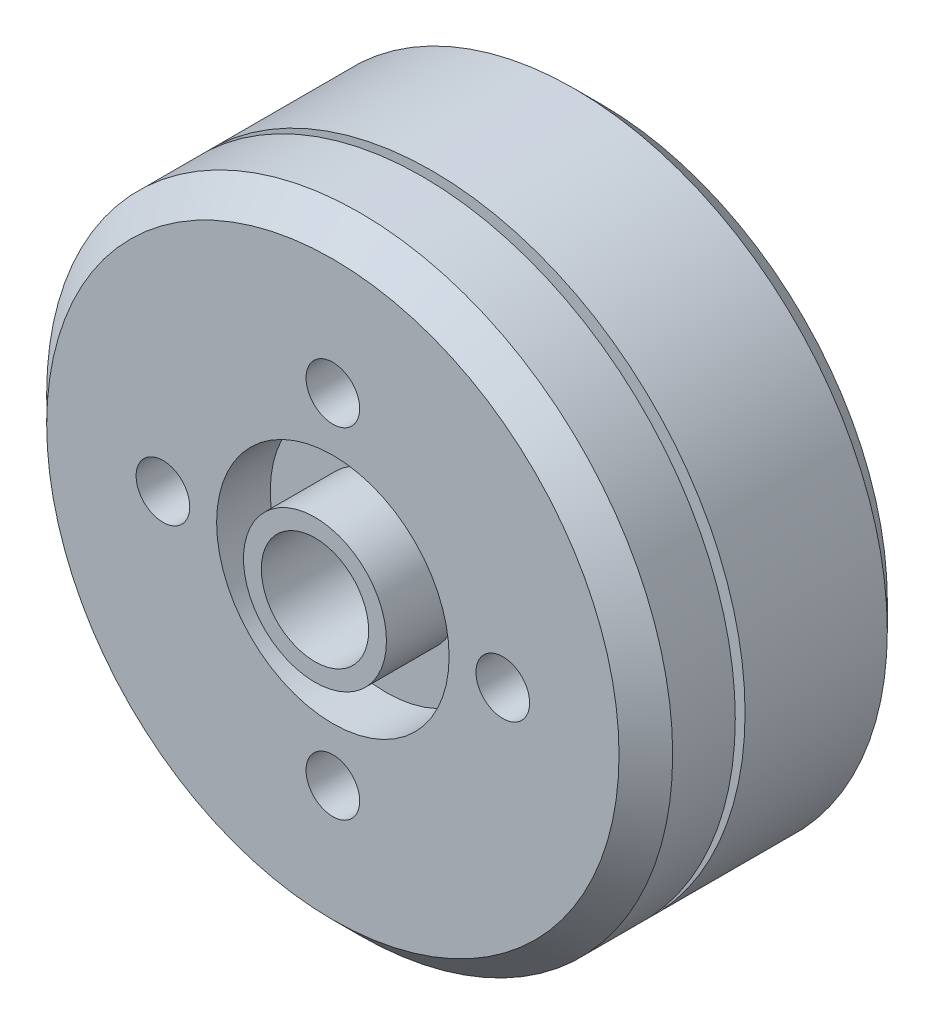
ISO-10303-21;
HEADER;
FILE_DESCRIPTION(('STEP AP214'),'2;1');
FILE_NAME('part.step','',(''),(''),'','','');
FILE_SCHEMA(('AUTOMOTIVE_DESIGN { 1 0 10303 214 1 1 1 1 }'));
ENDSEC;
DATA;
#1=APPLICATION_CONTEXT('core data for automotive mechanical design processes');
#2=APPLICATION_PROTOCOL_DEFINITION('international standard','automotive_design',2000,#1);
#3=PRODUCT_CONTEXT('',#1,'mechanical');
#4=PRODUCT('Part','Part','',(#3));
#5=PRODUCT_RELATED_PRODUCT_CATEGORY('part','',(#4));
#6=PRODUCT_DEFINITION_FORMATION('','',#4);
#7=PRODUCT_DEFINITION_CONTEXT('part definition',#1,'design');
#8=PRODUCT_DEFINITION('design','',#6,#7);
#9=PRODUCT_DEFINITION_SHAPE('','',#8);
#10=(LENGTH_UNIT() NAMED_UNIT(*) SI_UNIT(.MILLI.,.METRE.));
#11=(NAMED_UNIT(*) PLANE_ANGLE_UNIT() SI_UNIT($,.RADIAN.));
#12=(NAMED_UNIT(*) SI_UNIT($,.STERADIAN.) SOLID_ANGLE_UNIT());
#13=UNCERTAINTY_MEASURE_WITH_UNIT(LENGTH_MEASURE(1.E-05),#10,'distance_accuracy_value','');
#14=(GEOMETRIC_REPRESENTATION_CONTEXT(3) GLOBAL_UNCERTAINTY_ASSIGNED_CONTEXT((#13)) GLOBAL_UNIT_ASSIGNED_CONTEXT((#10,
#11,#12)) REPRESENTATION_CONTEXT('',''));
#15=CARTESIAN_POINT('',(0.,0.,0.));
#16=DIRECTION('',(0.,0.,1.));
#17=DIRECTION('',(1.,0.,0.));
#18=AXIS2_PLACEMENT_3D('',#15,#16,#17);
#19=CARTESIAN_POINT('',(0.,0.,15.));
#20=DIRECTION('',(0.,0.,-1.));
#21=DIRECTION('',(-1.,0.,0.));
#22=AXIS2_PLACEMENT_3D('',#19,#20,#21);
#23=CYLINDRICAL_SURFACE('',#22,17.5);
#24=CARTESIAN_POINT('',(0.,0.,1.5));
#25=DIRECTION('',(0.,0.,1.));
#26=DIRECTION('',(1.,0.,0.));
#27=AXIS2_PLACEMENT_3D('',#24,#25,#26);
#28=CIRCLE('',#27,17.5);
#29=CARTESIAN_POINT('',(17.5,0.,1.5));
#30=VERTEX_POINT('',#29);
#31=EDGE_CURVE('E45',#30,#30,#28,.T.);
#32=ORIENTED_EDGE('',*,*,#31,.T.);
#33=EDGE_LOOP('',(#32));
#34=FACE_BOUND('',#33,.T.);
#35=CARTESIAN_POINT('',(0.,0.,9.45314457112844));
#36=DIRECTION('',(0.,0.,-1.));
#37=DIRECTION('',(-1.,0.,0.));
#38=AXIS2_PLACEMENT_3D('',#35,#36,#37);
#39=CIRCLE('',#38,17.5);
#40=CARTESIAN_POINT('',(-17.5,0.,9.45314457112844));
#41=VERTEX_POINT('',#40);
#42=EDGE_CURVE('E67',#41,#41,#39,.T.);
#43=ORIENTED_EDGE('',*,*,#42,.T.);
#44=EDGE_LOOP('',(#43));
#45=FACE_BOUND('',#44,.T.);
#46=ADVANCED_FACE('F37',(#34,#45),#23,.T.);
#47=CARTESIAN_POINT('',(0.,0.,0.));
#48=DIRECTION('',(0.,0.,1.));
#49=DIRECTION('',(1.,0.,0.));
#50=AXIS2_PLACEMENT_3D('',#47,#48,#49);
#51=PLANE('',#50);
#52=CARTESIAN_POINT('',(0.,0.,0.));
#53=DIRECTION('',(0.,0.,1.));
#54=DIRECTION('',(1.,0.,0.));
#55=AXIS2_PLACEMENT_3D('',#52,#53,#54);
#56=CIRCLE('',#55,16.);
#57=CARTESIAN_POINT('',(16.,0.,0.));
#58=VERTEX_POINT('',#57);
#59=EDGE_CURVE('E10',#58,#58,#56,.F.);
#60=ORIENTED_EDGE('',*,*,#59,.T.);
#61=EDGE_LOOP('',(#60));
#62=FACE_BOUND('',#61,.T.);
#63=CARTESIAN_POINT('',(0.,0.,0.));
#64=DIRECTION('',(0.,0.,-1.));
#65=DIRECTION('',(-1.,0.,0.));
#66=AXIS2_PLACEMENT_3D('',#63,#64,#65);
#67=CIRCLE('',#66,3.);
#68=CARTESIAN_POINT('',(-3.,0.,0.));
#69=VERTEX_POINT('',#68);
#70=EDGE_CURVE('E109',#69,#69,#67,.T.);
#71=ORIENTED_EDGE('',*,*,#70,.F.);
#72=EDGE_LOOP('',(#71));
#73=FACE_BOUND('',#72,.T.);
#74=CARTESIAN_POINT('',(0.,-8.,0.));
#75=DIRECTION('',(0.,0.,-1.));
#76=DIRECTION('',(-1.,0.,0.));
#77=AXIS2_PLACEMENT_3D('',#74,#75,#76);
#78=CIRCLE('',#77,1.5);
#79=CARTESIAN_POINT('',(-1.5,-8.,0.));
#80=VERTEX_POINT('',#79);
#81=EDGE_CURVE('E95',#80,#80,#78,.T.);
#82=ORIENTED_EDGE('',*,*,#81,.F.);
#83=EDGE_LOOP('',(#82));
#84=FACE_BOUND('',#83,.T.);
#85=CARTESIAN_POINT('',(8.,0.,0.));
#86=DIRECTION('',(0.,0.,-1.));
#87=DIRECTION('',(-1.,0.,0.));
#88=AXIS2_PLACEMENT_3D('',#85,#86,#87);
#89=CIRCLE('',#88,1.5);
#90=CARTESIAN_POINT('',(6.5,0.,0.));
#91=VERTEX_POINT('',#90);
#92=EDGE_CURVE('E87',#91,#91,#89,.T.);
#93=ORIENTED_EDGE('',*,*,#92,.F.);
#94=EDGE_LOOP('',(#93));
#95=FACE_BOUND('',#94,.T.);
#96=CARTESIAN_POINT('',(0.,8.,0.));
#97=DIRECTION('',(0.,0.,-1.));
#98=DIRECTION('',(-1.,0.,0.));
#99=AXIS2_PLACEMENT_3D('',#96,#97,#98);
#100=CIRCLE('',#99,1.5);
#101=CARTESIAN_POINT('',(-1.50000000000005,8.,0.));
#102=VERTEX_POINT('',#101);
#103=EDGE_CURVE('E79',#102,#102,#100,.T.);
#104=ORIENTED_EDGE('',*,*,#103,.F.);
#105=EDGE_LOOP('',(#104));
#106=FACE_BOUND('',#105,.T.);
#107=CARTESIAN_POINT('',(-8.,0.,0.));
#108=DIRECTION('',(0.,0.,-1.));
#109=DIRECTION('',(-1.,0.,0.));
#110=AXIS2_PLACEMENT_3D('',#107,#108,#109);
#111=CIRCLE('',#110,1.5);
#112=CARTESIAN_POINT('',(-9.5,0.,0.));
#113=VERTEX_POINT('',#112);
#114=EDGE_CURVE('E66',#113,#113,#111,.T.);
#115=ORIENTED_EDGE('',*,*,#114,.F.);
#116=EDGE_LOOP('',(#115));
#117=FACE_BOUND('',#116,.T.);
#118=ADVANCED_FACE('F180',(#62,#73,#84,#95,#106,#117),#51,.F.);
#119=CARTESIAN_POINT('',(-8.,0.,4.99999999999999));
#120=DIRECTION('',(0.,0.,-1.));
#121=DIRECTION('',(-1.,0.,0.));
#122=AXIS2_PLACEMENT_3D('',#119,#120,#121);
#123=CYLINDRICAL_SURFACE('',#122,1.5);
#124=CARTESIAN_POINT('',(-8.,0.,4.99999999999999));
#125=DIRECTION('',(0.,0.,-1.));
#126=DIRECTION('',(-1.,0.,0.));
#127=AXIS2_PLACEMENT_3D('',#124,#125,#126);
#128=CIRCLE('',#127,1.5);
#129=CARTESIAN_POINT('',(-9.5,0.,4.99999999999999));
#130=VERTEX_POINT('',#129);
#131=EDGE_CURVE('E75',#130,#130,#128,.T.);
#132=ORIENTED_EDGE('',*,*,#131,.F.);
#133=EDGE_LOOP('',(#132));
#134=FACE_BOUND('',#133,.T.);
#135=ORIENTED_EDGE('',*,*,#114,.T.);
#136=EDGE_LOOP('',(#135));
#137=FACE_BOUND('',#136,.T.);
#138=ADVANCED_FACE('F186',(#134,#137),#123,.F.);
#139=CARTESIAN_POINT('',(-8.,0.,4.99999999999999));
#140=DIRECTION('',(0.,0.,-1.));
#141=DIRECTION('',(-1.,0.,0.));
#142=AXIS2_PLACEMENT_3D('',#139,#140,#141);
#143=PLANE('',#142);
#144=ORIENTED_EDGE('',*,*,#131,.T.);
#145=EDGE_LOOP('',(#144));
#146=FACE_BOUND('',#145,.T.);
#147=ADVANCED_FACE('F242',(#146),#143,.T.);
#148=CARTESIAN_POINT('',(0.,8.,4.99999999999999));
#149=DIRECTION('',(0.,0.,-1.));
#150=DIRECTION('',(-1.,0.,0.));
#151=AXIS2_PLACEMENT_3D('',#148,#149,#150);
#152=CYLINDRICAL_SURFACE('',#151,1.5);
#153=CARTESIAN_POINT('',(0.,8.,4.99999999999999));
#154=DIRECTION('',(0.,0.,-1.));
#155=DIRECTION('',(-1.,0.,0.));
#156=AXIS2_PLACEMENT_3D('',#153,#154,#155);
#157=CIRCLE('',#156,1.5);
#158=CARTESIAN_POINT('',(-1.50000000000005,8.,4.99999999999999));
#159=VERTEX_POINT('',#158);
#160=EDGE_CURVE('E83',#159,#159,#157,.T.);
#161=ORIENTED_EDGE('',*,*,#160,.F.);
#162=EDGE_LOOP('',(#161));
#163=FACE_BOUND('',#162,.T.);
#164=ORIENTED_EDGE('',*,*,#103,.T.);
#165=EDGE_LOOP('',(#164));
#166=FACE_BOUND('',#165,.T.);
#167=ADVANCED_FACE('F238',(#163,#166),#152,.F.);
#168=CARTESIAN_POINT('',(0.,8.,4.99999999999999));
#169=DIRECTION('',(0.,0.,-1.));
#170=DIRECTION('',(-1.,0.,0.));
#171=AXIS2_PLACEMENT_3D('',#168,#169,#170);
#172=PLANE('',#171);
#173=ORIENTED_EDGE('',*,*,#160,.T.);
#174=EDGE_LOOP('',(#173));
#175=FACE_BOUND('',#174,.T.);
#176=ADVANCED_FACE('F234',(#175),#172,.T.);
#177=CARTESIAN_POINT('',(8.,0.,4.99999999999999));
#178=DIRECTION('',(0.,0.,-1.));
#179=DIRECTION('',(-1.,0.,0.));
#180=AXIS2_PLACEMENT_3D('',#177,#178,#179);
#181=CYLINDRICAL_SURFACE('',#180,1.5);
#182=CARTESIAN_POINT('',(8.,0.,4.99999999999999));
#183=DIRECTION('',(0.,0.,-1.));
#184=DIRECTION('',(-1.,0.,0.));
#185=AXIS2_PLACEMENT_3D('',#182,#183,#184);
#186=CIRCLE('',#185,1.5);
#187=CARTESIAN_POINT('',(6.5,0.,4.99999999999999));
#188=VERTEX_POINT('',#187);
#189=EDGE_CURVE('E91',#188,#188,#186,.T.);
#190=ORIENTED_EDGE('',*,*,#189,.F.);
#191=EDGE_LOOP('',(#190));
#192=FACE_BOUND('',#191,.T.);
#193=ORIENTED_EDGE('',*,*,#92,.T.);
#194=EDGE_LOOP('',(#193));
#195=FACE_BOUND('',#194,.T.);
#196=ADVANCED_FACE('F230',(#192,#195),#181,.F.);
#197=CARTESIAN_POINT('',(8.,0.,4.99999999999999));
#198=DIRECTION('',(0.,0.,-1.));
#199=DIRECTION('',(-1.,0.,0.));
#200=AXIS2_PLACEMENT_3D('',#197,#198,#199);
#201=PLANE('',#200);
#202=ORIENTED_EDGE('',*,*,#189,.T.);
#203=EDGE_LOOP('',(#202));
#204=FACE_BOUND('',#203,.T.);
#205=ADVANCED_FACE('F226',(#204),#201,.T.);
#206=CARTESIAN_POINT('',(0.,-8.,4.99999999999999));
#207=DIRECTION('',(0.,0.,-1.));
#208=DIRECTION('',(-1.,0.,0.));
#209=AXIS2_PLACEMENT_3D('',#206,#207,#208);
#210=CYLINDRICAL_SURFACE('',#209,1.5);
#211=CARTESIAN_POINT('',(0.,-8.,4.99999999999999));
#212=DIRECTION('',(0.,0.,-1.));
#213=DIRECTION('',(-1.,0.,0.));
#214=AXIS2_PLACEMENT_3D('',#211,#212,#213);
#215=CIRCLE('',#214,1.5);
#216=CARTESIAN_POINT('',(-1.5,-8.,4.99999999999999));
#217=VERTEX_POINT('',#216);
#218=EDGE_CURVE('E61',#217,#217,#215,.T.);
#219=ORIENTED_EDGE('',*,*,#218,.F.);
#220=EDGE_LOOP('',(#219));
#221=FACE_BOUND('',#220,.T.);
#222=ORIENTED_EDGE('',*,*,#81,.T.);
#223=EDGE_LOOP('',(#222));
#224=FACE_BOUND('',#223,.T.);
#225=ADVANCED_FACE('F218',(#221,#224),#210,.F.);
#226=CARTESIAN_POINT('',(0.,-8.,4.99999999999999));
#227=DIRECTION('',(0.,0.,-1.));
#228=DIRECTION('',(-1.,0.,0.));
#229=AXIS2_PLACEMENT_3D('',#226,#227,#228);
#230=PLANE('',#229);
#231=ORIENTED_EDGE('',*,*,#218,.T.);
#232=EDGE_LOOP('',(#231));
#233=FACE_BOUND('',#232,.T.);
#234=ADVANCED_FACE('F209',(#233),#230,.T.);
#235=CARTESIAN_POINT('',(17.969347124329,0.,10.));
#236=DIRECTION('',(0.,0.,1.));
#237=DIRECTION('',(1.,0.,0.));
#238=AXIS2_PLACEMENT_3D('',#235,#236,#237);
#239=PLANE('',#238);
#240=CARTESIAN_POINT('',(0.,0.,10.));
#241=DIRECTION('',(0.,0.,-1.));
#242=DIRECTION('',(-1.,0.,0.));
#243=AXIS2_PLACEMENT_3D('',#240,#241,#242);
#244=CIRCLE('',#243,13.2844337972272);
#245=CARTESIAN_POINT('',(-13.2844337972272,0.,10.));
#246=VERTEX_POINT('',#245);
#247=EDGE_CURVE('E105',#246,#246,#244,.T.);
#248=ORIENTED_EDGE('',*,*,#247,.F.);
#249=EDGE_LOOP('',(#248));
#250=FACE_BOUND('',#249,.T.);
#251=CARTESIAN_POINT('',(0.,0.,10.));
#252=DIRECTION('',(0.,0.,1.));
#253=DIRECTION('',(1.,0.,0.));
#254=AXIS2_PLACEMENT_3D('',#251,#252,#253);
#255=CIRCLE('',#254,17.5);
#256=CARTESIAN_POINT('',(17.5,0.,10.));
#257=VERTEX_POINT('',#256);
#258=EDGE_CURVE('E62',#257,#257,#255,.T.);
#259=ORIENTED_EDGE('',*,*,#258,.F.);
#260=EDGE_LOOP('',(#259));
#261=FACE_BOUND('',#260,.T.);
#262=ADVANCED_FACE('F206',(#250,#261),#239,.F.);
#263=CARTESIAN_POINT('',(13.2844337972272,0.,9.45314457112844));
#264=DIRECTION('',(0.,0.,-1.));
#265=DIRECTION('',(-1.,0.,0.));
#266=AXIS2_PLACEMENT_3D('',#263,#264,#265);
#267=PLANE('',#266);
#268=CARTESIAN_POINT('',(0.,0.,9.45314457112844));
#269=DIRECTION('',(0.,0.,-1.));
#270=DIRECTION('',(-1.,0.,0.));
#271=AXIS2_PLACEMENT_3D('',#268,#269,#270);
#272=CIRCLE('',#271,13.2844337972272);
#273=CARTESIAN_POINT('',(-13.2844337972272,0.,9.45314457112844));
#274=VERTEX_POINT('',#273);
#275=EDGE_CURVE('E71',#274,#274,#272,.T.);
#276=ORIENTED_EDGE('',*,*,#275,.T.);
#277=EDGE_LOOP('',(#276));
#278=FACE_BOUND('',#277,.T.);
#279=ORIENTED_EDGE('',*,*,#42,.F.);
#280=EDGE_LOOP('',(#279));
#281=FACE_BOUND('',#280,.T.);
#282=ADVANCED_FACE('F208',(#278,#281),#267,.F.);
#283=CARTESIAN_POINT('',(0.,0.,0.));
#284=DIRECTION('',(0.,0.,-1.));
#285=DIRECTION('',(-1.,0.,0.));
#286=AXIS2_PLACEMENT_3D('',#283,#284,#285);
#287=CYLINDRICAL_SURFACE('',#286,13.2844337972272);
#288=ORIENTED_EDGE('',*,*,#247,.T.);
#289=EDGE_LOOP('',(#288));
#290=FACE_BOUND('',#289,.T.);
#291=ORIENTED_EDGE('',*,*,#275,.F.);
#292=EDGE_LOOP('',(#291));
#293=FACE_BOUND('',#292,.T.);
#294=ADVANCED_FACE('F199',(#290,#293),#287,.T.);
#295=CARTESIAN_POINT('',(0.,0.,15.));
#296=DIRECTION('',(0.,0.,1.));
#297=DIRECTION('',(1.,0.,0.));
#298=AXIS2_PLACEMENT_3D('',#295,#296,#297);
#299=PLANE('',#298);
#300=CARTESIAN_POINT('',(0.,0.,15.));
#301=DIRECTION('',(0.,0.,1.));
#302=DIRECTION('',(1.,0.,0.));
#303=AXIS2_PLACEMENT_3D('',#300,#301,#302);
#304=CIRCLE('',#303,6.5);
#305=CARTESIAN_POINT('',(6.5,0.,15.));
#306=VERTEX_POINT('',#305);
#307=EDGE_CURVE('E146',#306,#306,#304,.T.);
#308=ORIENTED_EDGE('',*,*,#307,.F.);
#309=EDGE_LOOP('',(#308));
#310=FACE_BOUND('',#309,.T.);
#311=CARTESIAN_POINT('',(0.,0.,15.));
#312=DIRECTION('',(0.,0.,1.));
#313=DIRECTION('',(1.,0.,0.));
#314=AXIS2_PLACEMENT_3D('',#311,#312,#313);
#315=CIRCLE('',#314,16.);
#316=CARTESIAN_POINT('',(16.,0.,15.));
#317=VERTEX_POINT('',#316);
#318=EDGE_CURVE('E55',#317,#317,#315,.T.);
#319=ORIENTED_EDGE('',*,*,#318,.T.);
#320=EDGE_LOOP('',(#319));
#321=FACE_BOUND('',#320,.T.);
#322=CARTESIAN_POINT('',(0.,-9.5,15.));
#323=DIRECTION('',(0.,0.,1.));
#324=DIRECTION('',(1.,0.,0.));
#325=AXIS2_PLACEMENT_3D('',#322,#323,#324);
#326=CIRCLE('',#325,1.5);
#327=CARTESIAN_POINT('',(1.5,-9.5,15.));
#328=VERTEX_POINT('',#327);
#329=EDGE_CURVE('E139',#328,#328,#326,.T.);
#330=ORIENTED_EDGE('',*,*,#329,.F.);
#331=EDGE_LOOP('',(#330));
#332=FACE_BOUND('',#331,.T.);
#333=CARTESIAN_POINT('',(-9.5,0.,15.));
#334=DIRECTION('',(0.,0.,1.));
#335=DIRECTION('',(1.,0.,0.));
#336=AXIS2_PLACEMENT_3D('',#333,#334,#335);
#337=CIRCLE('',#336,1.5);
#338=CARTESIAN_POINT('',(-8.,0.,15.));
#339=VERTEX_POINT('',#338);
#340=EDGE_CURVE('E131',#339,#339,#337,.T.);
#341=ORIENTED_EDGE('',*,*,#340,.F.);
#342=EDGE_LOOP('',(#341));
#343=FACE_BOUND('',#342,.T.);
#344=CARTESIAN_POINT('',(0.,9.5,15.));
#345=DIRECTION('',(0.,0.,1.));
#346=DIRECTION('',(1.,0.,0.));
#347=AXIS2_PLACEMENT_3D('',#344,#345,#346);
#348=CIRCLE('',#347,1.5);
#349=CARTESIAN_POINT('',(1.50000000000007,9.5,15.));
#350=VERTEX_POINT('',#349);
#351=EDGE_CURVE('E123',#350,#350,#348,.T.);
#352=ORIENTED_EDGE('',*,*,#351,.F.);
#353=EDGE_LOOP('',(#352));
#354=FACE_BOUND('',#353,.T.);
#355=CARTESIAN_POINT('',(9.5,-1.00078527173816E-13,15.));
#356=DIRECTION('',(0.,0.,1.));
#357=DIRECTION('',(1.,0.,0.));
#358=AXIS2_PLACEMENT_3D('',#355,#356,#357);
#359=CIRCLE('',#358,1.5);
#360=CARTESIAN_POINT('',(11.,-1.00078527173816E-13,15.));
#361=VERTEX_POINT('',#360);
#362=EDGE_CURVE('E114',#361,#361,#359,.T.);
#363=ORIENTED_EDGE('',*,*,#362,.F.);
#364=EDGE_LOOP('',(#363));
#365=FACE_BOUND('',#364,.T.);
#366=ADVANCED_FACE('F190',(#310,#321,#332,#343,#354,#365),#299,.T.);
#367=CARTESIAN_POINT('',(0.,0.,13.5));
#368=DIRECTION('',(0.,0.,1.));
#369=DIRECTION('',(1.,0.,0.));
#370=AXIS2_PLACEMENT_3D('',#367,#368,#369);
#371=CIRCLE('',#370,17.5);
#372=CARTESIAN_POINT('',(17.5,0.,13.5));
#373=VERTEX_POINT('',#372);
#374=EDGE_CURVE('E50',#373,#373,#371,.F.);
#375=ORIENTED_EDGE('',*,*,#374,.T.);
#376=EDGE_LOOP('',(#375));
#377=FACE_BOUND('',#376,.T.);
#378=ORIENTED_EDGE('',*,*,#258,.T.);
#379=EDGE_LOOP('',(#378));
#380=FACE_BOUND('',#379,.T.);
#381=ADVANCED_FACE('F182',(#377,#380),#23,.T.);
#382=CARTESIAN_POINT('',(0.,0.,20.));
#383=DIRECTION('',(0.,0.,-1.));
#384=DIRECTION('',(-1.,0.,0.));
#385=AXIS2_PLACEMENT_3D('',#382,#383,#384);
#386=CYLINDRICAL_SURFACE('',#385,3.);
#387=ORIENTED_EDGE('',*,*,#70,.T.);
#388=EDGE_LOOP('',(#387));
#389=FACE_BOUND('',#388,.T.);
#390=CARTESIAN_POINT('',(0.,0.,16.));
#391=DIRECTION('',(0.,0.,1.));
#392=DIRECTION('',(1.,0.,0.));
#393=AXIS2_PLACEMENT_3D('',#390,#391,#392);
#394=CIRCLE('',#393,3.);
#395=CARTESIAN_POINT('',(3.,0.,16.));
#396=VERTEX_POINT('',#395);
#397=EDGE_CURVE('E161',#396,#396,#394,.T.);
#398=ORIENTED_EDGE('',*,*,#397,.T.);
#399=EDGE_LOOP('',(#398));
#400=FACE_BOUND('',#399,.T.);
#401=ADVANCED_FACE('F166',(#389,#400),#386,.F.);
#402=CARTESIAN_POINT('',(9.5,-1.00078527173816E-13,9.00000000000001));
#403=DIRECTION('',(0.,0.,1.));
#404=DIRECTION('',(1.,0.,0.));
#405=AXIS2_PLACEMENT_3D('',#402,#403,#404);
#406=CYLINDRICAL_SURFACE('',#405,1.5);
#407=CARTESIAN_POINT('',(9.5,-1.00078527173816E-13,9.00000000000001));
#408=DIRECTION('',(0.,0.,1.));
#409=DIRECTION('',(1.,0.,0.));
#410=AXIS2_PLACEMENT_3D('',#407,#408,#409);
#411=CIRCLE('',#410,1.5);
#412=CARTESIAN_POINT('',(11.,-1.00078527173816E-13,9.00000000000001));
#413=VERTEX_POINT('',#412);
#414=EDGE_CURVE('E118',#413,#413,#411,.T.);
#415=ORIENTED_EDGE('',*,*,#414,.F.);
#416=EDGE_LOOP('',(#415));
#417=FACE_BOUND('',#416,.T.);
#418=ORIENTED_EDGE('',*,*,#362,.T.);
#419=EDGE_LOOP('',(#418));
#420=FACE_BOUND('',#419,.T.);
#421=ADVANCED_FACE('F196',(#417,#420),#406,.F.);
#422=CARTESIAN_POINT('',(9.5,-1.00078527173816E-13,9.00000000000001));
#423=DIRECTION('',(0.,0.,1.));
#424=DIRECTION('',(1.,0.,0.));
#425=AXIS2_PLACEMENT_3D('',#422,#423,#424);
#426=PLANE('',#425);
#427=ORIENTED_EDGE('',*,*,#414,.T.);
#428=EDGE_LOOP('',(#427));
#429=FACE_BOUND('',#428,.T.);
#430=ADVANCED_FACE('F315',(#429),#426,.T.);
#431=CARTESIAN_POINT('',(0.,9.5,9.00000000000001));
#432=DIRECTION('',(0.,0.,1.));
#433=DIRECTION('',(1.,0.,0.));
#434=AXIS2_PLACEMENT_3D('',#431,#432,#433);
#435=CYLINDRICAL_SURFACE('',#434,1.5);
#436=CARTESIAN_POINT('',(0.,9.5,9.00000000000001));
#437=DIRECTION('',(0.,0.,1.));
#438=DIRECTION('',(1.,0.,0.));
#439=AXIS2_PLACEMENT_3D('',#436,#437,#438);
#440=CIRCLE('',#439,1.5);
#441=CARTESIAN_POINT('',(1.50000000000007,9.5,9.00000000000001));
#442=VERTEX_POINT('',#441);
#443=EDGE_CURVE('E127',#442,#442,#440,.T.);
#444=ORIENTED_EDGE('',*,*,#443,.F.);
#445=EDGE_LOOP('',(#444));
#446=FACE_BOUND('',#445,.T.);
#447=ORIENTED_EDGE('',*,*,#351,.T.);
#448=EDGE_LOOP('',(#447));
#449=FACE_BOUND('',#448,.T.);
#450=ADVANCED_FACE('F325',(#446,#449),#435,.F.);
#451=CARTESIAN_POINT('',(0.,9.5,9.00000000000001));
#452=DIRECTION('',(0.,0.,1.));
#453=DIRECTION('',(1.,0.,0.));
#454=AXIS2_PLACEMENT_3D('',#451,#452,#453);
#455=PLANE('',#454);
#456=ORIENTED_EDGE('',*,*,#443,.T.);
#457=EDGE_LOOP('',(#456));
#458=FACE_BOUND('',#457,.T.);
#459=ADVANCED_FACE('F335',(#458),#455,.T.);
#460=CARTESIAN_POINT('',(-9.5,0.,9.00000000000001));
#461=DIRECTION('',(0.,0.,1.));
#462=DIRECTION('',(1.,0.,0.));
#463=AXIS2_PLACEMENT_3D('',#460,#461,#462);
#464=CYLINDRICAL_SURFACE('',#463,1.5);
#465=CARTESIAN_POINT('',(-9.5,0.,9.00000000000001));
#466=DIRECTION('',(0.,0.,1.));
#467=DIRECTION('',(1.,0.,0.));
#468=AXIS2_PLACEMENT_3D('',#465,#466,#467);
#469=CIRCLE('',#468,1.5);
#470=CARTESIAN_POINT('',(-8.,0.,9.00000000000001));
#471=VERTEX_POINT('',#470);
#472=EDGE_CURVE('E135',#471,#471,#469,.T.);
#473=ORIENTED_EDGE('',*,*,#472,.F.);
#474=EDGE_LOOP('',(#473));
#475=FACE_BOUND('',#474,.T.);
#476=ORIENTED_EDGE('',*,*,#340,.T.);
#477=EDGE_LOOP('',(#476));
#478=FACE_BOUND('',#477,.T.);
#479=ADVANCED_FACE('F345',(#475,#478),#464,.F.);
#480=CARTESIAN_POINT('',(-9.5,0.,9.00000000000001));
#481=DIRECTION('',(0.,0.,1.));
#482=DIRECTION('',(1.,0.,0.));
#483=AXIS2_PLACEMENT_3D('',#480,#481,#482);
#484=PLANE('',#483);
#485=ORIENTED_EDGE('',*,*,#472,.T.);
#486=EDGE_LOOP('',(#485));
#487=FACE_BOUND('',#486,.T.);
#488=ADVANCED_FACE('F355',(#487),#484,.T.);
#489=CARTESIAN_POINT('',(0.,-9.5,9.00000000000001));
#490=DIRECTION('',(0.,0.,1.));
#491=DIRECTION('',(1.,0.,0.));
#492=AXIS2_PLACEMENT_3D('',#489,#490,#491);
#493=CYLINDRICAL_SURFACE('',#492,1.5);
#494=CARTESIAN_POINT('',(0.,-9.5,9.00000000000001));
#495=DIRECTION('',(0.,0.,1.));
#496=DIRECTION('',(1.,0.,0.));
#497=AXIS2_PLACEMENT_3D('',#494,#495,#496);
#498=CIRCLE('',#497,1.5);
#499=CARTESIAN_POINT('',(1.5,-9.5,9.00000000000001));
#500=VERTEX_POINT('',#499);
#501=EDGE_CURVE('E113',#500,#500,#498,.T.);
#502=ORIENTED_EDGE('',*,*,#501,.F.);
#503=EDGE_LOOP('',(#502));
#504=FACE_BOUND('',#503,.T.);
#505=ORIENTED_EDGE('',*,*,#329,.T.);
#506=EDGE_LOOP('',(#505));
#507=FACE_BOUND('',#506,.T.);
#508=ADVANCED_FACE('F365',(#504,#507),#493,.F.);
#509=CARTESIAN_POINT('',(0.,-9.5,9.00000000000001));
#510=DIRECTION('',(0.,0.,1.));
#511=DIRECTION('',(1.,0.,0.));
#512=AXIS2_PLACEMENT_3D('',#509,#510,#511);
#513=PLANE('',#512);
#514=ORIENTED_EDGE('',*,*,#501,.T.);
#515=EDGE_LOOP('',(#514));
#516=FACE_BOUND('',#515,.T.);
#517=ADVANCED_FACE('F375',(#516),#513,.T.);
#518=CARTESIAN_POINT('',(0.,0.,15.));
#519=DIRECTION('',(0.,0.,-1.));
#520=DIRECTION('',(-1.,0.,0.));
#521=AXIS2_PLACEMENT_3D('',#518,#519,#520);
#522=CONICAL_SURFACE('',#521,16.,0.785398163397446);
#523=ORIENTED_EDGE('',*,*,#374,.F.);
#524=EDGE_LOOP('',(#523));
#525=FACE_BOUND('',#524,.T.);
#526=ORIENTED_EDGE('',*,*,#318,.F.);
#527=EDGE_LOOP('',(#526));
#528=FACE_BOUND('',#527,.T.);
#529=ADVANCED_FACE('F384',(#525,#528),#522,.T.);
#530=CARTESIAN_POINT('',(0.,0.,1.5));
#531=DIRECTION('',(0.,0.,1.));
#532=DIRECTION('',(1.,0.,0.));
#533=AXIS2_PLACEMENT_3D('',#530,#531,#532);
#534=CONICAL_SURFACE('',#533,17.5,0.785398163397449);
#535=ORIENTED_EDGE('',*,*,#59,.F.);
#536=EDGE_LOOP('',(#535));
#537=FACE_BOUND('',#536,.T.);
#538=ORIENTED_EDGE('',*,*,#31,.F.);
#539=EDGE_LOOP('',(#538));
#540=FACE_BOUND('',#539,.T.);
#541=ADVANCED_FACE('F39',(#537,#540),#534,.T.);
#542=CARTESIAN_POINT('',(0.,0.,12.));
#543=DIRECTION('',(0.,0.,1.));
#544=DIRECTION('',(1.,0.,0.));
#545=AXIS2_PLACEMENT_3D('',#542,#543,#544);
#546=CYLINDRICAL_SURFACE('',#545,6.5);
#547=CARTESIAN_POINT('',(0.,0.,12.));
#548=DIRECTION('',(0.,0.,1.));
#549=DIRECTION('',(1.,0.,0.));
#550=AXIS2_PLACEMENT_3D('',#547,#548,#549);
#551=CIRCLE('',#550,6.5);
#552=CARTESIAN_POINT('',(6.5,0.,12.));
#553=VERTEX_POINT('',#552);
#554=EDGE_CURVE('E119',#553,#553,#551,.T.);
#555=ORIENTED_EDGE('',*,*,#554,.F.);
#556=EDGE_LOOP('',(#555));
#557=FACE_BOUND('',#556,.T.);
#558=ORIENTED_EDGE('',*,*,#307,.T.);
#559=EDGE_LOOP('',(#558));
#560=FACE_BOUND('',#559,.T.);
#561=ADVANCED_FACE('F415',(#557,#560),#546,.F.);
#562=CARTESIAN_POINT('',(0.,0.,12.));
#563=DIRECTION('',(0.,0.,1.));
#564=DIRECTION('',(1.,0.,0.));
#565=AXIS2_PLACEMENT_3D('',#562,#563,#564);
#566=PLANE('',#565);
#567=CARTESIAN_POINT('',(0.,0.,12.));
#568=DIRECTION('',(0.,0.,1.));
#569=DIRECTION('',(1.,0.,0.));
#570=AXIS2_PLACEMENT_3D('',#567,#568,#569);
#571=CIRCLE('',#570,3.99661585051879);
#572=CARTESIAN_POINT('',(3.99661585051879,0.,12.));
#573=VERTEX_POINT('',#572);
#574=EDGE_CURVE('E150',#573,#573,#571,.T.);
#575=ORIENTED_EDGE('',*,*,#574,.F.);
#576=EDGE_LOOP('',(#575));
#577=FACE_BOUND('',#576,.T.);
#578=ORIENTED_EDGE('',*,*,#554,.T.);
#579=EDGE_LOOP('',(#578));
#580=FACE_BOUND('',#579,.T.);
#581=ADVANCED_FACE('F176',(#577,#580),#566,.T.);
#582=CARTESIAN_POINT('',(0.,0.,12.));
#583=DIRECTION('',(0.,0.,1.));
#584=DIRECTION('',(1.,0.,0.));
#585=AXIS2_PLACEMENT_3D('',#582,#583,#584);
#586=CYLINDRICAL_SURFACE('',#585,3.99661585051879);
#587=ORIENTED_EDGE('',*,*,#574,.T.);
#588=EDGE_LOOP('',(#587));
#589=FACE_BOUND('',#588,.T.);
#590=CARTESIAN_POINT('',(0.,0.,16.));
#591=DIRECTION('',(0.,0.,1.));
#592=DIRECTION('',(1.,0.,0.));
#593=AXIS2_PLACEMENT_3D('',#590,#591,#592);
#594=CIRCLE('',#593,3.99661585051879);
#595=CARTESIAN_POINT('',(3.99661585051879,0.,16.));
#596=VERTEX_POINT('',#595);
#597=EDGE_CURVE('E157',#596,#596,#594,.T.);
#598=ORIENTED_EDGE('',*,*,#597,.F.);
#599=EDGE_LOOP('',(#598));
#600=FACE_BOUND('',#599,.T.);
#601=ADVANCED_FACE('F170',(#589,#600),#586,.T.);
#602=CARTESIAN_POINT('',(0.,0.,16.));
#603=DIRECTION('',(0.,0.,1.));
#604=DIRECTION('',(1.,0.,0.));
#605=AXIS2_PLACEMENT_3D('',#602,#603,#604);
#606=PLANE('',#605);
#607=ORIENTED_EDGE('',*,*,#597,.T.);
#608=EDGE_LOOP('',(#607));
#609=FACE_BOUND('',#608,.T.);
#610=ORIENTED_EDGE('',*,*,#397,.F.);
#611=EDGE_LOOP('',(#610));
#612=FACE_BOUND('',#611,.T.);
#613=ADVANCED_FACE('F168',(#609,#612),#606,.T.);
#614=CLOSED_SHELL('',(#46,#118,#138,#147,#167,#176,#196,#205,#225,#234,#262,#282,#294,#366,#381,
#401,#421,#430,#450,#459,#479,#488,#508,#517,#529,#541,#561,#581,#601,#613));
#615=MANIFOLD_SOLID_BREP('B2',#614);
#616=ADVANCED_BREP_SHAPE_REPRESENTATION('',(#18,#615),#14);
#617=SHAPE_DEFINITION_REPRESENTATION(#9,#616);
ENDSEC;
END-ISO-10303-21;
